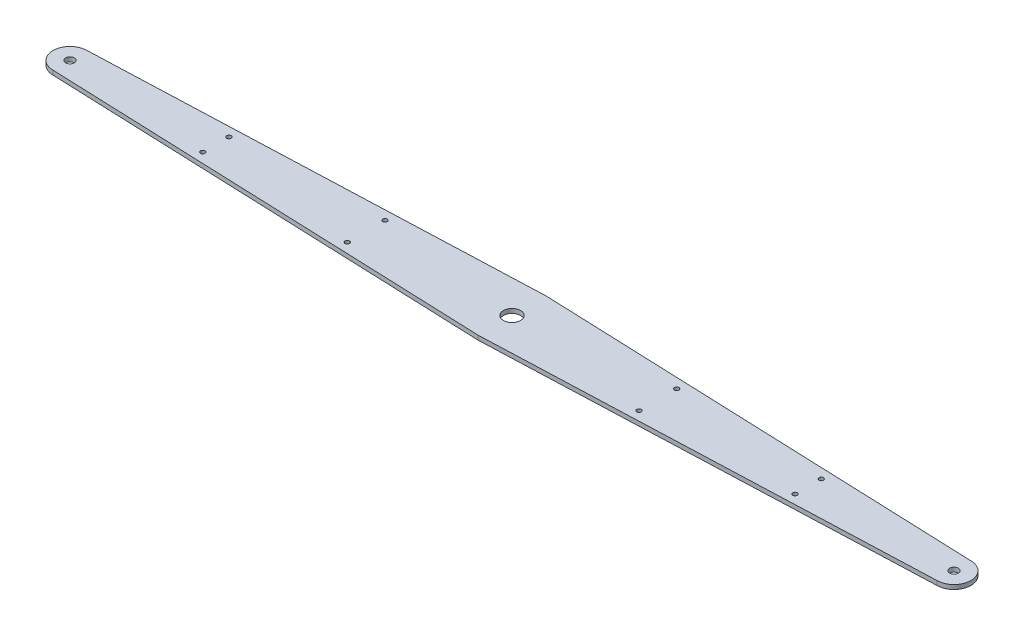
ISO-10303-21;
HEADER;
FILE_DESCRIPTION(('STEP AP214'),'2;1');
FILE_NAME('part.step','',(''),(''),'','','');
FILE_SCHEMA(('AUTOMOTIVE_DESIGN { 1 0 10303 214 1 1 1 1 }'));
ENDSEC;
DATA;
#1=APPLICATION_CONTEXT('core data for automotive mechanical design processes');
#2=APPLICATION_PROTOCOL_DEFINITION('international standard','automotive_design',2000,#1);
#3=PRODUCT_CONTEXT('',#1,'mechanical');
#4=PRODUCT('Part','Part','',(#3));
#5=PRODUCT_RELATED_PRODUCT_CATEGORY('part','',(#4));
#6=PRODUCT_DEFINITION_FORMATION('','',#4);
#7=PRODUCT_DEFINITION_CONTEXT('part definition',#1,'design');
#8=PRODUCT_DEFINITION('design','',#6,#7);
#9=PRODUCT_DEFINITION_SHAPE('','',#8);
#10=(LENGTH_UNIT() NAMED_UNIT(*) SI_UNIT(.MILLI.,.METRE.));
#11=(NAMED_UNIT(*) PLANE_ANGLE_UNIT() SI_UNIT($,.RADIAN.));
#12=(NAMED_UNIT(*) SI_UNIT($,.STERADIAN.) SOLID_ANGLE_UNIT());
#13=UNCERTAINTY_MEASURE_WITH_UNIT(LENGTH_MEASURE(1.E-05),#10,'distance_accuracy_value','');
#14=(GEOMETRIC_REPRESENTATION_CONTEXT(3) GLOBAL_UNCERTAINTY_ASSIGNED_CONTEXT((#13)) GLOBAL_UNIT_ASSIGNED_CONTEXT((#10,
#11,#12)) REPRESENTATION_CONTEXT('',''));
#15=CARTESIAN_POINT('',(0.,0.,0.));
#16=DIRECTION('',(0.,0.,1.));
#17=DIRECTION('',(1.,0.,0.));
#18=AXIS2_PLACEMENT_3D('',#15,#16,#17);
#19=CARTESIAN_POINT('',(325.,3.18,-12.5));
#20=DIRECTION('',(-0.0384331221012045,0.,0.999261174631314));
#21=DIRECTION('',(0.999261174631314,0.,0.0384331221012045));
#22=AXIS2_PLACEMENT_3D('',#19,#20,#21);
#23=PLANE('',#22);
#24=DIRECTION('',(-0.999261174631314,0.,-0.0384331221012045));
#25=VECTOR('',#24,1.);
#26=CARTESIAN_POINT('',(325.,0.,-12.5));
#27=LINE('',#26,#25);
#28=CARTESIAN_POINT('',(325.,0.,-12.5));
#29=VERTEX_POINT('',#28);
#30=CARTESIAN_POINT('',(0.,0.,-25.));
#31=VERTEX_POINT('',#30);
#32=EDGE_CURVE('E128',#29,#31,#27,.T.);
#33=ORIENTED_EDGE('',*,*,#32,.T.);
#34=DIRECTION('',(0.,-1.,0.));
#35=VECTOR('',#34,1.);
#36=CARTESIAN_POINT('',(0.,3.18,-25.));
#37=LINE('',#36,#35);
#38=CARTESIAN_POINT('',(0.,3.18,-25.));
#39=VERTEX_POINT('',#38);
#40=EDGE_CURVE('E11',#39,#31,#37,.T.);
#41=ORIENTED_EDGE('',*,*,#40,.F.);
#42=DIRECTION('',(-0.999261174631314,0.,-0.0384331221012045));
#43=VECTOR('',#42,1.);
#44=CARTESIAN_POINT('',(325.,3.18,-12.5));
#45=LINE('',#44,#43);
#46=CARTESIAN_POINT('',(325.,3.18,-12.5));
#47=VERTEX_POINT('',#46);
#48=EDGE_CURVE('E139',#47,#39,#45,.T.);
#49=ORIENTED_EDGE('',*,*,#48,.F.);
#50=DIRECTION('',(0.,-1.,0.));
#51=VECTOR('',#50,1.);
#52=CARTESIAN_POINT('',(325.,3.18,-12.5));
#53=LINE('',#52,#51);
#54=EDGE_CURVE('E124',#47,#29,#53,.T.);
#55=ORIENTED_EDGE('',*,*,#54,.T.);
#56=EDGE_LOOP('',(#33,#41,#49,#55));
#57=FACE_BOUND('',#56,.T.);
#58=ADVANCED_FACE('F44',(#57),#23,.F.);
#59=CARTESIAN_POINT('',(-325.,3.18,-12.5));
#60=DIRECTION('',(0.0384331221012045,0.,0.999261174631314));
#61=DIRECTION('',(0.999261174631314,0.,-0.0384331221012045));
#62=AXIS2_PLACEMENT_3D('',#59,#60,#61);
#63=PLANE('',#62);
#64=DIRECTION('',(-0.999261174631314,0.,0.0384331221012045));
#65=VECTOR('',#64,1.);
#66=CARTESIAN_POINT('',(-325.,0.,-12.5));
#67=LINE('',#66,#65);
#68=CARTESIAN_POINT('',(-325.,0.,-12.5));
#69=VERTEX_POINT('',#68);
#70=EDGE_CURVE('E131',#31,#69,#67,.T.);
#71=ORIENTED_EDGE('',*,*,#70,.T.);
#72=DIRECTION('',(0.,-1.,0.));
#73=VECTOR('',#72,1.);
#74=CARTESIAN_POINT('',(-325.,3.18,-12.5));
#75=LINE('',#74,#73);
#76=CARTESIAN_POINT('',(-325.,3.18,-12.5));
#77=VERTEX_POINT('',#76);
#78=EDGE_CURVE('E52',#77,#69,#75,.T.);
#79=ORIENTED_EDGE('',*,*,#78,.F.);
#80=DIRECTION('',(-0.999261174631314,0.,0.0384331221012045));
#81=VECTOR('',#80,1.);
#82=CARTESIAN_POINT('',(-325.,3.18,-12.5));
#83=LINE('',#82,#81);
#84=EDGE_CURVE('E97',#39,#77,#83,.T.);
#85=ORIENTED_EDGE('',*,*,#84,.F.);
#86=ORIENTED_EDGE('',*,*,#40,.T.);
#87=EDGE_LOOP('',(#71,#79,#85,#86));
#88=FACE_BOUND('',#87,.T.);
#89=ADVANCED_FACE('F164',(#88),#63,.F.);
#90=CARTESIAN_POINT('',(-325.,3.18,0.));
#91=DIRECTION('',(0.,-1.,0.));
#92=DIRECTION('',(0.,0.,-1.));
#93=AXIS2_PLACEMENT_3D('',#90,#91,#92);
#94=CYLINDRICAL_SURFACE('',#93,12.5);
#95=CARTESIAN_POINT('',(-325.,0.,0.));
#96=DIRECTION('',(0.,1.,0.));
#97=DIRECTION('',(0.,0.,1.));
#98=AXIS2_PLACEMENT_3D('',#95,#96,#97);
#99=CIRCLE('',#98,12.5);
#100=CARTESIAN_POINT('',(-325.,0.,12.5));
#101=VERTEX_POINT('',#100);
#102=EDGE_CURVE('E134',#69,#101,#99,.T.);
#103=ORIENTED_EDGE('',*,*,#102,.T.);
#104=DIRECTION('',(0.,-1.,0.));
#105=VECTOR('',#104,1.);
#106=CARTESIAN_POINT('',(-325.,3.18,12.5));
#107=LINE('',#106,#105);
#108=CARTESIAN_POINT('',(-325.,3.18,12.5));
#109=VERTEX_POINT('',#108);
#110=EDGE_CURVE('E119',#109,#101,#107,.T.);
#111=ORIENTED_EDGE('',*,*,#110,.F.);
#112=CARTESIAN_POINT('',(-325.,3.18,0.));
#113=DIRECTION('',(0.,1.,0.));
#114=DIRECTION('',(0.,0.,1.));
#115=AXIS2_PLACEMENT_3D('',#112,#113,#114);
#116=CIRCLE('',#115,12.5);
#117=EDGE_CURVE('E110',#77,#109,#116,.T.);
#118=ORIENTED_EDGE('',*,*,#117,.F.);
#119=ORIENTED_EDGE('',*,*,#78,.T.);
#120=EDGE_LOOP('',(#103,#111,#118,#119));
#121=FACE_BOUND('',#120,.T.);
#122=ADVANCED_FACE('F145',(#121),#94,.T.);
#123=CARTESIAN_POINT('',(-325.,3.18,12.5));
#124=DIRECTION('',(0.0384331221012043,0.,-0.999261174631314));
#125=DIRECTION('',(-0.999261174631314,0.,-0.0384331221012043));
#126=AXIS2_PLACEMENT_3D('',#123,#124,#125);
#127=PLANE('',#126);
#128=DIRECTION('',(0.999261174631314,0.,0.0384331221012043));
#129=VECTOR('',#128,1.);
#130=CARTESIAN_POINT('',(-325.,0.,12.5));
#131=LINE('',#130,#129);
#132=CARTESIAN_POINT('',(0.,0.,25.));
#133=VERTEX_POINT('',#132);
#134=EDGE_CURVE('E118',#101,#133,#131,.T.);
#135=ORIENTED_EDGE('',*,*,#134,.T.);
#136=DIRECTION('',(0.,-1.,0.));
#137=VECTOR('',#136,1.);
#138=CARTESIAN_POINT('',(0.,3.18,25.));
#139=LINE('',#138,#137);
#140=CARTESIAN_POINT('',(0.,3.18,25.));
#141=VERTEX_POINT('',#140);
#142=EDGE_CURVE('E115',#141,#133,#139,.T.);
#143=ORIENTED_EDGE('',*,*,#142,.F.);
#144=DIRECTION('',(0.999261174631314,0.,0.0384331221012043));
#145=VECTOR('',#144,1.);
#146=CARTESIAN_POINT('',(-325.,3.18,12.5));
#147=LINE('',#146,#145);
#148=EDGE_CURVE('E104',#109,#141,#147,.T.);
#149=ORIENTED_EDGE('',*,*,#148,.F.);
#150=ORIENTED_EDGE('',*,*,#110,.T.);
#151=EDGE_LOOP('',(#135,#143,#149,#150));
#152=FACE_BOUND('',#151,.T.);
#153=ADVANCED_FACE('F116',(#152),#127,.F.);
#154=CARTESIAN_POINT('',(325.,3.18,12.5));
#155=DIRECTION('',(-0.0384331221012043,0.,-0.999261174631314));
#156=DIRECTION('',(-0.999261174631314,0.,0.0384331221012043));
#157=AXIS2_PLACEMENT_3D('',#154,#155,#156);
#158=PLANE('',#157);
#159=DIRECTION('',(0.999261174631314,0.,-0.0384331221012043));
#160=VECTOR('',#159,1.);
#161=CARTESIAN_POINT('',(325.,0.,12.5));
#162=LINE('',#161,#160);
#163=CARTESIAN_POINT('',(325.,0.,12.5));
#164=VERTEX_POINT('',#163);
#165=EDGE_CURVE('E83',#133,#164,#162,.T.);
#166=ORIENTED_EDGE('',*,*,#165,.T.);
#167=DIRECTION('',(0.,-1.,0.));
#168=VECTOR('',#167,1.);
#169=CARTESIAN_POINT('',(325.,3.18,12.5));
#170=LINE('',#169,#168);
#171=CARTESIAN_POINT('',(325.,3.18,12.5));
#172=VERTEX_POINT('',#171);
#173=EDGE_CURVE('E120',#172,#164,#170,.T.);
#174=ORIENTED_EDGE('',*,*,#173,.F.);
#175=DIRECTION('',(0.999261174631314,0.,-0.0384331221012043));
#176=VECTOR('',#175,1.);
#177=CARTESIAN_POINT('',(325.,3.18,12.5));
#178=LINE('',#177,#176);
#179=EDGE_CURVE('E108',#141,#172,#178,.T.);
#180=ORIENTED_EDGE('',*,*,#179,.F.);
#181=ORIENTED_EDGE('',*,*,#142,.T.);
#182=EDGE_LOOP('',(#166,#174,#180,#181));
#183=FACE_BOUND('',#182,.T.);
#184=ADVANCED_FACE('F122',(#183),#158,.F.);
#185=CARTESIAN_POINT('',(325.,3.18,0.));
#186=DIRECTION('',(0.,-1.,0.));
#187=DIRECTION('',(0.,0.,-1.));
#188=AXIS2_PLACEMENT_3D('',#185,#186,#187);
#189=CYLINDRICAL_SURFACE('',#188,12.5);
#190=CARTESIAN_POINT('',(325.,0.,0.));
#191=DIRECTION('',(0.,1.,0.));
#192=DIRECTION('',(0.,0.,-1.));
#193=AXIS2_PLACEMENT_3D('',#190,#191,#192);
#194=CIRCLE('',#193,12.5);
#195=EDGE_CURVE('E89',#164,#29,#194,.T.);
#196=ORIENTED_EDGE('',*,*,#195,.T.);
#197=ORIENTED_EDGE('',*,*,#54,.F.);
#198=CARTESIAN_POINT('',(325.,3.18,0.));
#199=DIRECTION('',(0.,1.,0.));
#200=DIRECTION('',(0.,0.,-1.));
#201=AXIS2_PLACEMENT_3D('',#198,#199,#200);
#202=CIRCLE('',#201,12.5);
#203=EDGE_CURVE('E60',#172,#47,#202,.T.);
#204=ORIENTED_EDGE('',*,*,#203,.F.);
#205=ORIENTED_EDGE('',*,*,#173,.T.);
#206=EDGE_LOOP('',(#196,#197,#204,#205));
#207=FACE_BOUND('',#206,.T.);
#208=ADVANCED_FACE('F152',(#207),#189,.T.);
#209=CARTESIAN_POINT('',(-325.,3.18,0.));
#210=DIRECTION('',(0.,1.,0.));
#211=DIRECTION('',(0.,0.,1.));
#212=AXIS2_PLACEMENT_3D('',#209,#210,#211);
#213=PLANE('',#212);
#214=CARTESIAN_POINT('',(-217.75,3.18,9.62499999999998));
#215=DIRECTION('',(0.,1.,0.));
#216=DIRECTION('',(0.,0.,-1.));
#217=AXIS2_PLACEMENT_3D('',#214,#215,#216);
#218=CIRCLE('',#217,1.65000000000002);
#219=CARTESIAN_POINT('',(-217.75,3.18,7.97499999999997));
#220=VERTEX_POINT('',#219);
#221=EDGE_CURVE('E321',#220,#220,#218,.T.);
#222=ORIENTED_EDGE('',*,*,#221,.F.);
#223=EDGE_LOOP('',(#222));
#224=FACE_BOUND('',#223,.T.);
#225=CARTESIAN_POINT('',(107.25,3.18,13.875));
#226=DIRECTION('',(0.,1.,0.));
#227=DIRECTION('',(0.,0.,-1.));
#228=AXIS2_PLACEMENT_3D('',#225,#226,#227);
#229=CIRCLE('',#228,1.65);
#230=CARTESIAN_POINT('',(107.25,3.18,12.225));
#231=VERTEX_POINT('',#230);
#232=EDGE_CURVE('E327',#231,#231,#229,.T.);
#233=ORIENTED_EDGE('',*,*,#232,.F.);
#234=EDGE_LOOP('',(#233));
#235=FACE_BOUND('',#234,.T.);
#236=CARTESIAN_POINT('',(107.25,3.18,-13.875));
#237=DIRECTION('',(0.,1.,0.));
#238=DIRECTION('',(0.,0.,1.));
#239=AXIS2_PLACEMENT_3D('',#236,#237,#238);
#240=CIRCLE('',#239,1.65);
#241=CARTESIAN_POINT('',(107.25,3.18,-12.225));
#242=VERTEX_POINT('',#241);
#243=EDGE_CURVE('E338',#242,#242,#240,.T.);
#244=ORIENTED_EDGE('',*,*,#243,.F.);
#245=EDGE_LOOP('',(#244));
#246=FACE_BOUND('',#245,.T.);
#247=CARTESIAN_POINT('',(217.75,3.18,9.62499999999993));
#248=DIRECTION('',(0.,1.,0.));
#249=DIRECTION('',(0.,0.,1.));
#250=AXIS2_PLACEMENT_3D('',#247,#248,#249);
#251=CIRCLE('',#250,1.65000000000002);
#252=CARTESIAN_POINT('',(217.75,3.18,11.2749999999999));
#253=VERTEX_POINT('',#252);
#254=EDGE_CURVE('E402',#253,#253,#251,.T.);
#255=ORIENTED_EDGE('',*,*,#254,.F.);
#256=EDGE_LOOP('',(#255));
#257=FACE_BOUND('',#256,.T.);
#258=CARTESIAN_POINT('',(-325.,3.18,0.));
#259=DIRECTION('',(0.,1.,0.));
#260=DIRECTION('',(0.,0.,1.));
#261=AXIS2_PLACEMENT_3D('',#258,#259,#260);
#262=CIRCLE('',#261,3.17499999999997);
#263=CARTESIAN_POINT('',(-325.,3.18,3.17500000000001));
#264=VERTEX_POINT('',#263);
#265=EDGE_CURVE('E348',#264,#264,#262,.T.);
#266=ORIENTED_EDGE('',*,*,#265,.F.);
#267=EDGE_LOOP('',(#266));
#268=FACE_BOUND('',#267,.T.);
#269=CARTESIAN_POINT('',(-107.25,3.18,-13.875));
#270=DIRECTION('',(0.,1.,0.));
#271=DIRECTION('',(0.,0.,-1.));
#272=AXIS2_PLACEMENT_3D('',#269,#270,#271);
#273=CIRCLE('',#272,1.65);
#274=CARTESIAN_POINT('',(-107.25,3.18,-15.525));
#275=VERTEX_POINT('',#274);
#276=EDGE_CURVE('E355',#275,#275,#273,.T.);
#277=ORIENTED_EDGE('',*,*,#276,.F.);
#278=EDGE_LOOP('',(#277));
#279=FACE_BOUND('',#278,.T.);
#280=CARTESIAN_POINT('',(-217.75,3.18,-9.62499999999998));
#281=DIRECTION('',(0.,1.,0.));
#282=DIRECTION('',(0.,0.,1.));
#283=AXIS2_PLACEMENT_3D('',#280,#281,#282);
#284=CIRCLE('',#283,1.65000000000002);
#285=CARTESIAN_POINT('',(-217.75,3.18,-7.97499999999997));
#286=VERTEX_POINT('',#285);
#287=EDGE_CURVE('E339',#286,#286,#284,.T.);
#288=ORIENTED_EDGE('',*,*,#287,.F.);
#289=EDGE_LOOP('',(#288));
#290=FACE_BOUND('',#289,.T.);
#291=CARTESIAN_POINT('',(-107.25,3.18,13.875));
#292=DIRECTION('',(0.,1.,0.));
#293=DIRECTION('',(0.,0.,1.));
#294=AXIS2_PLACEMENT_3D('',#291,#292,#293);
#295=CIRCLE('',#294,1.65);
#296=CARTESIAN_POINT('',(-107.25,3.18,15.525));
#297=VERTEX_POINT('',#296);
#298=EDGE_CURVE('E325',#297,#297,#295,.T.);
#299=ORIENTED_EDGE('',*,*,#298,.F.);
#300=EDGE_LOOP('',(#299));
#301=FACE_BOUND('',#300,.T.);
#302=CARTESIAN_POINT('',(325.,3.18,1.16128853915268E-13));
#303=DIRECTION('',(0.,1.,0.));
#304=DIRECTION('',(0.,0.,-1.));
#305=AXIS2_PLACEMENT_3D('',#302,#303,#304);
#306=CIRCLE('',#305,3.17499999999997);
#307=CARTESIAN_POINT('',(325.,3.18,-3.17499999999985));
#308=VERTEX_POINT('',#307);
#309=EDGE_CURVE('E384',#308,#308,#306,.T.);
#310=ORIENTED_EDGE('',*,*,#309,.F.);
#311=EDGE_LOOP('',(#310));
#312=FACE_BOUND('',#311,.T.);
#313=CARTESIAN_POINT('',(217.75,3.18,-9.62500000000003));
#314=DIRECTION('',(0.,1.,0.));
#315=DIRECTION('',(0.,0.,-1.));
#316=AXIS2_PLACEMENT_3D('',#313,#314,#315);
#317=CIRCLE('',#316,1.65000000000002);
#318=CARTESIAN_POINT('',(217.75,3.18,-11.2750000000001));
#319=VERTEX_POINT('',#318);
#320=EDGE_CURVE('E387',#319,#319,#317,.T.);
#321=ORIENTED_EDGE('',*,*,#320,.F.);
#322=EDGE_LOOP('',(#321));
#323=FACE_BOUND('',#322,.T.);
#324=CARTESIAN_POINT('',(0.,3.18,0.));
#325=DIRECTION('',(0.,1.,0.));
#326=DIRECTION('',(0.,0.,1.));
#327=AXIS2_PLACEMENT_3D('',#324,#325,#326);
#328=CIRCLE('',#327,6.35);
#329=CARTESIAN_POINT('',(0.,3.18,6.35));
#330=VERTEX_POINT('',#329);
#331=EDGE_CURVE('E351',#330,#330,#328,.T.);
#332=ORIENTED_EDGE('',*,*,#331,.F.);
#333=EDGE_LOOP('',(#332));
#334=FACE_BOUND('',#333,.T.);
#335=ORIENTED_EDGE('',*,*,#48,.T.);
#336=ORIENTED_EDGE('',*,*,#84,.T.);
#337=ORIENTED_EDGE('',*,*,#117,.T.);
#338=ORIENTED_EDGE('',*,*,#148,.T.);
#339=ORIENTED_EDGE('',*,*,#179,.T.);
#340=ORIENTED_EDGE('',*,*,#203,.T.);
#341=EDGE_LOOP('',(#335,#336,#337,#338,#339,#340));
#342=FACE_BOUND('',#341,.T.);
#343=ADVANCED_FACE('F106',(#224,#235,#246,#257,#268,#279,#290,#301,#312,#323,#334,#342),#213,.T.);
#344=CARTESIAN_POINT('',(-325.,0.,0.));
#345=DIRECTION('',(0.,1.,0.));
#346=DIRECTION('',(0.,0.,1.));
#347=AXIS2_PLACEMENT_3D('',#344,#345,#346);
#348=PLANE('',#347);
#349=CARTESIAN_POINT('',(-217.75,0.,9.62499999999998));
#350=DIRECTION('',(0.,1.,0.));
#351=DIRECTION('',(0.,0.,-1.));
#352=AXIS2_PLACEMENT_3D('',#349,#350,#351);
#353=CIRCLE('',#352,1.65000000000002);
#354=CARTESIAN_POINT('',(-217.75,0.,7.97499999999997));
#355=VERTEX_POINT('',#354);
#356=EDGE_CURVE('E318',#355,#355,#353,.T.);
#357=ORIENTED_EDGE('',*,*,#356,.T.);
#358=EDGE_LOOP('',(#357));
#359=FACE_BOUND('',#358,.T.);
#360=CARTESIAN_POINT('',(107.25,0.,13.875));
#361=DIRECTION('',(0.,1.,0.));
#362=DIRECTION('',(0.,0.,-1.));
#363=AXIS2_PLACEMENT_3D('',#360,#361,#362);
#364=CIRCLE('',#363,1.65);
#365=CARTESIAN_POINT('',(107.25,0.,12.225));
#366=VERTEX_POINT('',#365);
#367=EDGE_CURVE('E335',#366,#366,#364,.T.);
#368=ORIENTED_EDGE('',*,*,#367,.T.);
#369=EDGE_LOOP('',(#368));
#370=FACE_BOUND('',#369,.T.);
#371=CARTESIAN_POINT('',(107.25,0.,-13.875));
#372=DIRECTION('',(0.,1.,0.));
#373=DIRECTION('',(0.,0.,1.));
#374=AXIS2_PLACEMENT_3D('',#371,#372,#373);
#375=CIRCLE('',#374,1.65);
#376=CARTESIAN_POINT('',(107.25,0.,-12.225));
#377=VERTEX_POINT('',#376);
#378=EDGE_CURVE('E400',#377,#377,#375,.T.);
#379=ORIENTED_EDGE('',*,*,#378,.T.);
#380=EDGE_LOOP('',(#379));
#381=FACE_BOUND('',#380,.T.);
#382=CARTESIAN_POINT('',(217.75,0.,9.62499999999993));
#383=DIRECTION('',(0.,1.,0.));
#384=DIRECTION('',(0.,0.,1.));
#385=AXIS2_PLACEMENT_3D('',#382,#383,#384);
#386=CIRCLE('',#385,1.65000000000002);
#387=CARTESIAN_POINT('',(217.75,0.,11.2749999999999));
#388=VERTEX_POINT('',#387);
#389=EDGE_CURVE('E330',#388,#388,#386,.T.);
#390=ORIENTED_EDGE('',*,*,#389,.T.);
#391=EDGE_LOOP('',(#390));
#392=FACE_BOUND('',#391,.T.);
#393=CARTESIAN_POINT('',(-325.,0.,0.));
#394=DIRECTION('',(0.,1.,0.));
#395=DIRECTION('',(0.,0.,1.));
#396=AXIS2_PLACEMENT_3D('',#393,#394,#395);
#397=CIRCLE('',#396,3.17499999999997);
#398=CARTESIAN_POINT('',(-325.,0.,3.17500000000001));
#399=VERTEX_POINT('',#398);
#400=EDGE_CURVE('E352',#399,#399,#397,.T.);
#401=ORIENTED_EDGE('',*,*,#400,.T.);
#402=EDGE_LOOP('',(#401));
#403=FACE_BOUND('',#402,.T.);
#404=CARTESIAN_POINT('',(-107.25,0.,-13.875));
#405=DIRECTION('',(0.,1.,0.));
#406=DIRECTION('',(0.,0.,-1.));
#407=AXIS2_PLACEMENT_3D('',#404,#405,#406);
#408=CIRCLE('',#407,1.65);
#409=CARTESIAN_POINT('',(-107.25,0.,-15.525));
#410=VERTEX_POINT('',#409);
#411=EDGE_CURVE('E342',#410,#410,#408,.T.);
#412=ORIENTED_EDGE('',*,*,#411,.T.);
#413=EDGE_LOOP('',(#412));
#414=FACE_BOUND('',#413,.T.);
#415=CARTESIAN_POINT('',(-217.75,0.,-9.62499999999998));
#416=DIRECTION('',(0.,1.,0.));
#417=DIRECTION('',(0.,0.,1.));
#418=AXIS2_PLACEMENT_3D('',#415,#416,#417);
#419=CIRCLE('',#418,1.65000000000002);
#420=CARTESIAN_POINT('',(-217.75,0.,-7.97499999999997));
#421=VERTEX_POINT('',#420);
#422=EDGE_CURVE('E343',#421,#421,#419,.T.);
#423=ORIENTED_EDGE('',*,*,#422,.T.);
#424=EDGE_LOOP('',(#423));
#425=FACE_BOUND('',#424,.T.);
#426=CARTESIAN_POINT('',(-107.25,0.,13.875));
#427=DIRECTION('',(0.,1.,0.));
#428=DIRECTION('',(0.,0.,1.));
#429=AXIS2_PLACEMENT_3D('',#426,#427,#428);
#430=CIRCLE('',#429,1.65);
#431=CARTESIAN_POINT('',(-107.25,0.,15.525));
#432=VERTEX_POINT('',#431);
#433=EDGE_CURVE('E322',#432,#432,#430,.T.);
#434=ORIENTED_EDGE('',*,*,#433,.T.);
#435=EDGE_LOOP('',(#434));
#436=FACE_BOUND('',#435,.T.);
#437=CARTESIAN_POINT('',(325.,0.,1.16128853915268E-13));
#438=DIRECTION('',(0.,1.,0.));
#439=DIRECTION('',(0.,0.,-1.));
#440=AXIS2_PLACEMENT_3D('',#437,#438,#439);
#441=CIRCLE('',#440,3.17499999999997);
#442=CARTESIAN_POINT('',(325.,0.,-3.17499999999985));
#443=VERTEX_POINT('',#442);
#444=EDGE_CURVE('E389',#443,#443,#441,.T.);
#445=ORIENTED_EDGE('',*,*,#444,.T.);
#446=EDGE_LOOP('',(#445));
#447=FACE_BOUND('',#446,.T.);
#448=CARTESIAN_POINT('',(217.75,0.,-9.62500000000003));
#449=DIRECTION('',(0.,1.,0.));
#450=DIRECTION('',(0.,0.,-1.));
#451=AXIS2_PLACEMENT_3D('',#448,#449,#450);
#452=CIRCLE('',#451,1.65000000000002);
#453=CARTESIAN_POINT('',(217.75,0.,-11.2750000000001));
#454=VERTEX_POINT('',#453);
#455=EDGE_CURVE('E390',#454,#454,#452,.T.);
#456=ORIENTED_EDGE('',*,*,#455,.T.);
#457=EDGE_LOOP('',(#456));
#458=FACE_BOUND('',#457,.T.);
#459=CARTESIAN_POINT('',(0.,0.,0.));
#460=DIRECTION('',(0.,1.,0.));
#461=DIRECTION('',(0.,0.,1.));
#462=AXIS2_PLACEMENT_3D('',#459,#460,#461);
#463=CIRCLE('',#462,6.35);
#464=CARTESIAN_POINT('',(0.,0.,6.35));
#465=VERTEX_POINT('',#464);
#466=EDGE_CURVE('E132',#465,#465,#463,.T.);
#467=ORIENTED_EDGE('',*,*,#466,.T.);
#468=EDGE_LOOP('',(#467));
#469=FACE_BOUND('',#468,.T.);
#470=ORIENTED_EDGE('',*,*,#32,.F.);
#471=ORIENTED_EDGE('',*,*,#195,.F.);
#472=ORIENTED_EDGE('',*,*,#165,.F.);
#473=ORIENTED_EDGE('',*,*,#134,.F.);
#474=ORIENTED_EDGE('',*,*,#102,.F.);
#475=ORIENTED_EDGE('',*,*,#70,.F.);
#476=EDGE_LOOP('',(#470,#471,#472,#473,#474,#475));
#477=FACE_BOUND('',#476,.T.);
#478=ADVANCED_FACE('F148',(#359,#370,#381,#392,#403,#414,#425,#436,#447,#458,#469,#477),#348,.F.);
#479=CARTESIAN_POINT('',(0.,0.,0.));
#480=DIRECTION('',(0.,1.,0.));
#481=DIRECTION('',(0.,0.,1.));
#482=AXIS2_PLACEMENT_3D('',#479,#480,#481);
#483=CYLINDRICAL_SURFACE('',#482,6.35);
#484=ORIENTED_EDGE('',*,*,#466,.F.);
#485=EDGE_LOOP('',(#484));
#486=FACE_BOUND('',#485,.T.);
#487=ORIENTED_EDGE('',*,*,#331,.T.);
#488=EDGE_LOOP('',(#487));
#489=FACE_BOUND('',#488,.T.);
#490=ADVANCED_FACE('F203',(#486,#489),#483,.F.);
#491=CARTESIAN_POINT('',(217.75,0.,-9.62500000000003));
#492=DIRECTION('',(0.,1.,0.));
#493=DIRECTION('',(0.,0.,1.));
#494=AXIS2_PLACEMENT_3D('',#491,#492,#493);
#495=CYLINDRICAL_SURFACE('',#494,1.65000000000002);
#496=ORIENTED_EDGE('',*,*,#455,.F.);
#497=EDGE_LOOP('',(#496));
#498=FACE_BOUND('',#497,.T.);
#499=ORIENTED_EDGE('',*,*,#320,.T.);
#500=EDGE_LOOP('',(#499));
#501=FACE_BOUND('',#500,.T.);
#502=ADVANCED_FACE('F212',(#498,#501),#495,.F.);
#503=CARTESIAN_POINT('',(325.,0.,1.16128853915268E-13));
#504=DIRECTION('',(0.,1.,0.));
#505=DIRECTION('',(0.,0.,1.));
#506=AXIS2_PLACEMENT_3D('',#503,#504,#505);
#507=CYLINDRICAL_SURFACE('',#506,3.17499999999997);
#508=ORIENTED_EDGE('',*,*,#444,.F.);
#509=EDGE_LOOP('',(#508));
#510=FACE_BOUND('',#509,.T.);
#511=ORIENTED_EDGE('',*,*,#309,.T.);
#512=EDGE_LOOP('',(#511));
#513=FACE_BOUND('',#512,.T.);
#514=ADVANCED_FACE('F222',(#510,#513),#507,.F.);
#515=CARTESIAN_POINT('',(-107.25,0.,13.875));
#516=DIRECTION('',(0.,1.,0.));
#517=DIRECTION('',(0.,0.,1.));
#518=AXIS2_PLACEMENT_3D('',#515,#516,#517);
#519=CYLINDRICAL_SURFACE('',#518,1.65);
#520=ORIENTED_EDGE('',*,*,#433,.F.);
#521=EDGE_LOOP('',(#520));
#522=FACE_BOUND('',#521,.T.);
#523=ORIENTED_EDGE('',*,*,#298,.T.);
#524=EDGE_LOOP('',(#523));
#525=FACE_BOUND('',#524,.T.);
#526=ADVANCED_FACE('F232',(#522,#525),#519,.F.);
#527=CARTESIAN_POINT('',(-217.75,0.,-9.62499999999998));
#528=DIRECTION('',(0.,1.,0.));
#529=DIRECTION('',(0.,0.,1.));
#530=AXIS2_PLACEMENT_3D('',#527,#528,#529);
#531=CYLINDRICAL_SURFACE('',#530,1.65000000000002);
#532=ORIENTED_EDGE('',*,*,#422,.F.);
#533=EDGE_LOOP('',(#532));
#534=FACE_BOUND('',#533,.T.);
#535=ORIENTED_EDGE('',*,*,#287,.T.);
#536=EDGE_LOOP('',(#535));
#537=FACE_BOUND('',#536,.T.);
#538=ADVANCED_FACE('F242',(#534,#537),#531,.F.);
#539=CARTESIAN_POINT('',(-107.25,0.,-13.875));
#540=DIRECTION('',(0.,1.,0.));
#541=DIRECTION('',(0.,0.,1.));
#542=AXIS2_PLACEMENT_3D('',#539,#540,#541);
#543=CYLINDRICAL_SURFACE('',#542,1.65);
#544=ORIENTED_EDGE('',*,*,#411,.F.);
#545=EDGE_LOOP('',(#544));
#546=FACE_BOUND('',#545,.T.);
#547=ORIENTED_EDGE('',*,*,#276,.T.);
#548=EDGE_LOOP('',(#547));
#549=FACE_BOUND('',#548,.T.);
#550=ADVANCED_FACE('F252',(#546,#549),#543,.F.);
#551=CARTESIAN_POINT('',(-325.,0.,0.));
#552=DIRECTION('',(0.,1.,0.));
#553=DIRECTION('',(0.,0.,1.));
#554=AXIS2_PLACEMENT_3D('',#551,#552,#553);
#555=CYLINDRICAL_SURFACE('',#554,3.17499999999997);
#556=ORIENTED_EDGE('',*,*,#400,.F.);
#557=EDGE_LOOP('',(#556));
#558=FACE_BOUND('',#557,.T.);
#559=ORIENTED_EDGE('',*,*,#265,.T.);
#560=EDGE_LOOP('',(#559));
#561=FACE_BOUND('',#560,.T.);
#562=ADVANCED_FACE('F262',(#558,#561),#555,.F.);
#563=CARTESIAN_POINT('',(217.75,0.,9.62499999999993));
#564=DIRECTION('',(0.,1.,0.));
#565=DIRECTION('',(0.,0.,1.));
#566=AXIS2_PLACEMENT_3D('',#563,#564,#565);
#567=CYLINDRICAL_SURFACE('',#566,1.65000000000002);
#568=ORIENTED_EDGE('',*,*,#389,.F.);
#569=EDGE_LOOP('',(#568));
#570=FACE_BOUND('',#569,.T.);
#571=ORIENTED_EDGE('',*,*,#254,.T.);
#572=EDGE_LOOP('',(#571));
#573=FACE_BOUND('',#572,.T.);
#574=ADVANCED_FACE('F272',(#570,#573),#567,.F.);
#575=CARTESIAN_POINT('',(107.25,0.,-13.875));
#576=DIRECTION('',(0.,1.,0.));
#577=DIRECTION('',(0.,0.,1.));
#578=AXIS2_PLACEMENT_3D('',#575,#576,#577);
#579=CYLINDRICAL_SURFACE('',#578,1.65);
#580=ORIENTED_EDGE('',*,*,#378,.F.);
#581=EDGE_LOOP('',(#580));
#582=FACE_BOUND('',#581,.T.);
#583=ORIENTED_EDGE('',*,*,#243,.T.);
#584=EDGE_LOOP('',(#583));
#585=FACE_BOUND('',#584,.T.);
#586=ADVANCED_FACE('F282',(#582,#585),#579,.F.);
#587=CARTESIAN_POINT('',(107.25,0.,13.875));
#588=DIRECTION('',(0.,1.,0.));
#589=DIRECTION('',(0.,0.,1.));
#590=AXIS2_PLACEMENT_3D('',#587,#588,#589);
#591=CYLINDRICAL_SURFACE('',#590,1.65);
#592=ORIENTED_EDGE('',*,*,#367,.F.);
#593=EDGE_LOOP('',(#592));
#594=FACE_BOUND('',#593,.T.);
#595=ORIENTED_EDGE('',*,*,#232,.T.);
#596=EDGE_LOOP('',(#595));
#597=FACE_BOUND('',#596,.T.);
#598=ADVANCED_FACE('F292',(#594,#597),#591,.F.);
#599=CARTESIAN_POINT('',(-217.75,0.,9.62499999999998));
#600=DIRECTION('',(0.,1.,0.));
#601=DIRECTION('',(0.,0.,1.));
#602=AXIS2_PLACEMENT_3D('',#599,#600,#601);
#603=CYLINDRICAL_SURFACE('',#602,1.65000000000002);
#604=ORIENTED_EDGE('',*,*,#356,.F.);
#605=EDGE_LOOP('',(#604));
#606=FACE_BOUND('',#605,.T.);
#607=ORIENTED_EDGE('',*,*,#221,.T.);
#608=EDGE_LOOP('',(#607));
#609=FACE_BOUND('',#608,.T.);
#610=ADVANCED_FACE('F302',(#606,#609),#603,.F.);
#611=CLOSED_SHELL('',(#58,#89,#122,#153,#184,#208,#343,#478,#490,#502,#514,#526,#538,#550,#562,
#574,#586,#598,#610));
#612=MANIFOLD_SOLID_BREP('B2',#611);
#613=ADVANCED_BREP_SHAPE_REPRESENTATION('',(#18,#612),#14);
#614=SHAPE_DEFINITION_REPRESENTATION(#9,#613);
ENDSEC;
END-ISO-10303-21;
